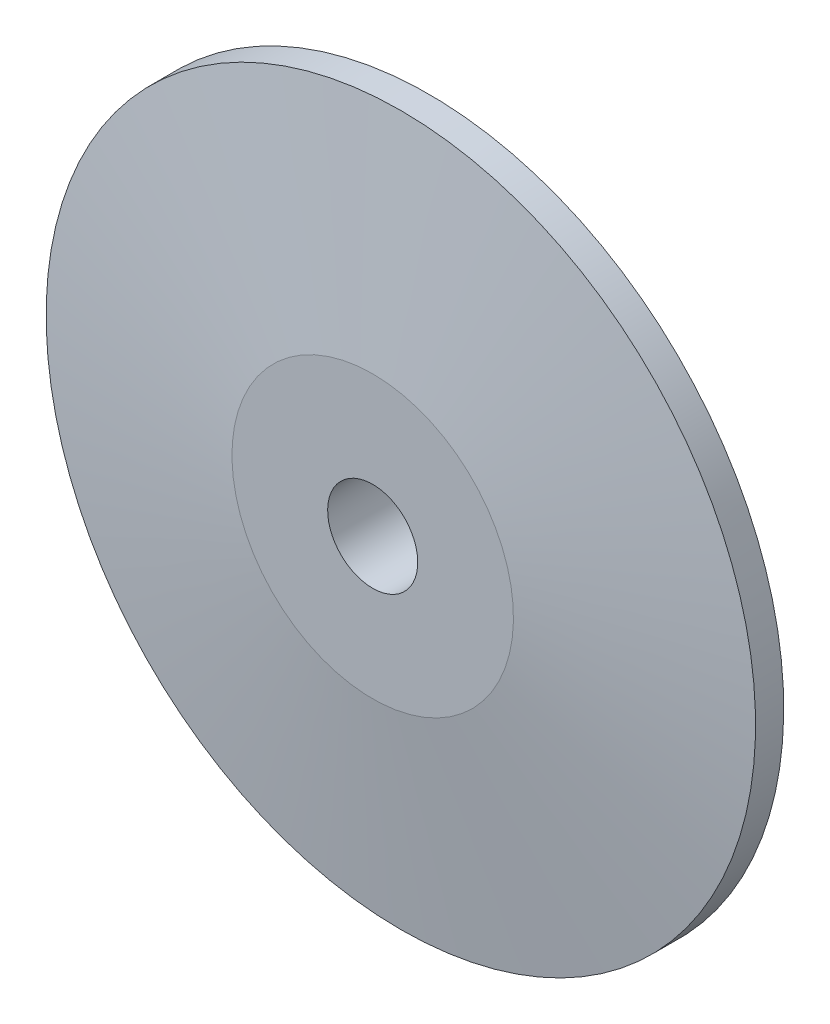
ISO-10303-21;
HEADER;
FILE_DESCRIPTION(('STEP AP214'),'2;1');
FILE_NAME('part.step','',(''),(''),'','','');
FILE_SCHEMA(('AUTOMOTIVE_DESIGN { 1 0 10303 214 1 1 1 1 }'));
ENDSEC;
DATA;
#1=APPLICATION_CONTEXT('core data for automotive mechanical design processes');
#2=APPLICATION_PROTOCOL_DEFINITION('international standard','automotive_design',2000,#1);
#3=PRODUCT_CONTEXT('',#1,'mechanical');
#4=PRODUCT('Part','Part','',(#3));
#5=PRODUCT_RELATED_PRODUCT_CATEGORY('part','',(#4));
#6=PRODUCT_DEFINITION_FORMATION('','',#4);
#7=PRODUCT_DEFINITION_CONTEXT('part definition',#1,'design');
#8=PRODUCT_DEFINITION('design','',#6,#7);
#9=PRODUCT_DEFINITION_SHAPE('','',#8);
#10=(LENGTH_UNIT() NAMED_UNIT(*) SI_UNIT(.MILLI.,.METRE.));
#11=(NAMED_UNIT(*) PLANE_ANGLE_UNIT() SI_UNIT($,.RADIAN.));
#12=(NAMED_UNIT(*) SI_UNIT($,.STERADIAN.) SOLID_ANGLE_UNIT());
#13=UNCERTAINTY_MEASURE_WITH_UNIT(LENGTH_MEASURE(1.E-05),#10,'distance_accuracy_value','');
#14=(GEOMETRIC_REPRESENTATION_CONTEXT(3) GLOBAL_UNCERTAINTY_ASSIGNED_CONTEXT((#13)) GLOBAL_UNIT_ASSIGNED_CONTEXT((#10,
#11,#12)) REPRESENTATION_CONTEXT('',''));
#15=CARTESIAN_POINT('',(0.,0.,0.));
#16=DIRECTION('',(0.,0.,1.));
#17=DIRECTION('',(1.,0.,0.));
#18=AXIS2_PLACEMENT_3D('',#15,#16,#17);
#19=CARTESIAN_POINT('',(0.,0.,0.));
#20=DIRECTION('',(0.,0.,1.));
#21=DIRECTION('',(0.,-1.,0.));
#22=AXIS2_PLACEMENT_3D('',#19,#20,#21);
#23=CYLINDRICAL_SURFACE('',#22,4.);
#24=CARTESIAN_POINT('',(0.,0.,0.));
#25=DIRECTION('',(0.,0.,-1.));
#26=DIRECTION('',(0.,1.,0.));
#27=AXIS2_PLACEMENT_3D('',#24,#25,#26);
#28=CIRCLE('',#27,4.);
#29=CARTESIAN_POINT('',(0.,4.,0.));
#30=VERTEX_POINT('',#29);
#31=EDGE_CURVE('E11',#30,#30,#28,.T.);
#32=ORIENTED_EDGE('',*,*,#31,.T.);
#33=EDGE_LOOP('',(#32));
#34=FACE_BOUND('',#33,.T.);
#35=CARTESIAN_POINT('',(0.,0.,20.));
#36=DIRECTION('',(0.,0.,-1.));
#37=DIRECTION('',(0.,1.,0.));
#38=AXIS2_PLACEMENT_3D('',#35,#36,#37);
#39=CIRCLE('',#38,4.);
#40=CARTESIAN_POINT('',(0.,-4.,20.));
#41=VERTEX_POINT('',#40);
#42=EDGE_CURVE('E99',#41,#41,#39,.T.);
#43=ORIENTED_EDGE('',*,*,#42,.F.);
#44=EDGE_LOOP('',(#43));
#45=FACE_BOUND('',#44,.T.);
#46=ADVANCED_FACE('F16',(#34,#45),#23,.F.);
#47=CARTESIAN_POINT('',(0.,0.,4.));
#48=DIRECTION('',(0.,0.,-1.));
#49=DIRECTION('',(0.,1.,0.));
#50=AXIS2_PLACEMENT_3D('',#47,#48,#49);
#51=CYLINDRICAL_SURFACE('',#50,7.5);
#52=CARTESIAN_POINT('',(0.,0.,4.));
#53=DIRECTION('',(0.,0.,-1.));
#54=DIRECTION('',(0.,1.,0.));
#55=AXIS2_PLACEMENT_3D('',#52,#53,#54);
#56=CIRCLE('',#55,7.5);
#57=CARTESIAN_POINT('',(0.,-7.5,4.));
#58=VERTEX_POINT('',#57);
#59=EDGE_CURVE('E26',#58,#58,#56,.T.);
#60=ORIENTED_EDGE('',*,*,#59,.T.);
#61=EDGE_LOOP('',(#60));
#62=FACE_BOUND('',#61,.T.);
#63=CARTESIAN_POINT('',(0.,0.,0.));
#64=DIRECTION('',(0.,0.,-1.));
#65=DIRECTION('',(0.,1.,0.));
#66=AXIS2_PLACEMENT_3D('',#63,#64,#65);
#67=CIRCLE('',#66,7.5);
#68=CARTESIAN_POINT('',(0.,7.5,0.));
#69=VERTEX_POINT('',#68);
#70=EDGE_CURVE('E103',#69,#69,#67,.T.);
#71=ORIENTED_EDGE('',*,*,#70,.F.);
#72=EDGE_LOOP('',(#71));
#73=FACE_BOUND('',#72,.T.);
#74=ADVANCED_FACE('F125',(#62,#73),#51,.T.);
#75=CARTESIAN_POINT('',(0.,0.,15.0213642611436));
#76=DIRECTION('',(0.,0.,-1.));
#77=DIRECTION('',(0.,1.,0.));
#78=AXIS2_PLACEMENT_3D('',#75,#76,#77);
#79=CONICAL_SURFACE('',#78,31.1738637185715,1.43996893072084);
#80=CARTESIAN_POINT('',(0.,0.,17.5));
#81=DIRECTION('',(0.,0.,1.));
#82=DIRECTION('',(0.,1.,0.));
#83=AXIS2_PLACEMENT_3D('',#80,#81,#82);
#84=CIRCLE('',#83,12.3362321032632);
#85=CARTESIAN_POINT('',(0.,-12.3362321032632,17.5));
#86=VERTEX_POINT('',#85);
#87=EDGE_CURVE('E108',#86,#86,#84,.T.);
#88=ORIENTED_EDGE('',*,*,#87,.T.);
#89=EDGE_LOOP('',(#88));
#90=FACE_BOUND('',#89,.T.);
#91=CARTESIAN_POINT('',(0.,0.,15.3073989609557));
#92=DIRECTION('',(0.,0.,1.));
#93=DIRECTION('',(0.,1.,0.));
#94=AXIS2_PLACEMENT_3D('',#91,#92,#93);
#95=CIRCLE('',#94,29.);
#96=CARTESIAN_POINT('',(0.,29.,15.3073989609557));
#97=VERTEX_POINT('',#96);
#98=EDGE_CURVE('E116',#97,#97,#95,.T.);
#99=ORIENTED_EDGE('',*,*,#98,.F.);
#100=EDGE_LOOP('',(#99));
#101=FACE_BOUND('',#100,.T.);
#102=ADVANCED_FACE('F143',(#90,#101),#79,.F.);
#103=CARTESIAN_POINT('',(0.,0.,15.));
#104=DIRECTION('',(0.,0.,1.));
#105=DIRECTION('',(0.,-1.,0.));
#106=AXIS2_PLACEMENT_3D('',#103,#104,#105);
#107=CYLINDRICAL_SURFACE('',#106,29.);
#108=CARTESIAN_POINT('',(0.,0.,15.));
#109=DIRECTION('',(0.,0.,-1.));
#110=DIRECTION('',(0.,1.,0.));
#111=AXIS2_PLACEMENT_3D('',#108,#109,#110);
#112=CIRCLE('',#111,29.);
#113=CARTESIAN_POINT('',(0.,29.,15.));
#114=VERTEX_POINT('',#113);
#115=EDGE_CURVE('E112',#114,#114,#112,.T.);
#116=ORIENTED_EDGE('',*,*,#115,.T.);
#117=EDGE_LOOP('',(#116));
#118=FACE_BOUND('',#117,.T.);
#119=ORIENTED_EDGE('',*,*,#98,.T.);
#120=EDGE_LOOP('',(#119));
#121=FACE_BOUND('',#120,.T.);
#122=ADVANCED_FACE('F169',(#118,#121),#107,.F.);
#123=CARTESIAN_POINT('',(0.,0.,17.5));
#124=DIRECTION('',(0.,0.,-1.));
#125=DIRECTION('',(0.,1.,0.));
#126=AXIS2_PLACEMENT_3D('',#123,#124,#125);
#127=CONICAL_SURFACE('',#126,31.5,1.43996893072084);
#128=CARTESIAN_POINT('',(0.,0.,20.));
#129=DIRECTION('',(0.,0.,1.));
#130=DIRECTION('',(0.,-1.,0.));
#131=AXIS2_PLACEMENT_3D('',#128,#129,#130);
#132=CIRCLE('',#131,12.5);
#133=CARTESIAN_POINT('',(0.,12.5,20.));
#134=VERTEX_POINT('',#133);
#135=EDGE_CURVE('E90',#134,#134,#132,.T.);
#136=ORIENTED_EDGE('',*,*,#135,.F.);
#137=EDGE_LOOP('',(#136));
#138=FACE_BOUND('',#137,.T.);
#139=CARTESIAN_POINT('',(0.,0.,17.5));
#140=DIRECTION('',(0.,0.,1.));
#141=DIRECTION('',(0.,-1.,0.));
#142=AXIS2_PLACEMENT_3D('',#139,#140,#141);
#143=CIRCLE('',#142,31.5);
#144=CARTESIAN_POINT('',(0.,31.5,17.5));
#145=VERTEX_POINT('',#144);
#146=EDGE_CURVE('E96',#145,#145,#143,.T.);
#147=ORIENTED_EDGE('',*,*,#146,.T.);
#148=EDGE_LOOP('',(#147));
#149=FACE_BOUND('',#148,.T.);
#150=ADVANCED_FACE('F163',(#138,#149),#127,.T.);
#151=CARTESIAN_POINT('',(0.,0.,15.));
#152=DIRECTION('',(0.,0.,1.));
#153=DIRECTION('',(0.,-1.,0.));
#154=AXIS2_PLACEMENT_3D('',#151,#152,#153);
#155=CYLINDRICAL_SURFACE('',#154,31.5);
#156=CARTESIAN_POINT('',(0.,0.,15.));
#157=DIRECTION('',(0.,0.,-1.));
#158=DIRECTION('',(0.,1.,0.));
#159=AXIS2_PLACEMENT_3D('',#156,#157,#158);
#160=CIRCLE('',#159,31.5);
#161=CARTESIAN_POINT('',(0.,-31.5,15.));
#162=VERTEX_POINT('',#161);
#163=EDGE_CURVE('E107',#162,#162,#160,.T.);
#164=ORIENTED_EDGE('',*,*,#163,.F.);
#165=EDGE_LOOP('',(#164));
#166=FACE_BOUND('',#165,.T.);
#167=ORIENTED_EDGE('',*,*,#146,.F.);
#168=EDGE_LOOP('',(#167));
#169=FACE_BOUND('',#168,.T.);
#170=ADVANCED_FACE('F159',(#166,#169),#155,.T.);
#171=CARTESIAN_POINT('',(0.,0.,42.6730014102411));
#172=DIRECTION('',(0.,0.,-1.));
#173=DIRECTION('',(0.,1.,0.));
#174=AXIS2_PLACEMENT_3D('',#171,#172,#173);
#175=CYLINDRICAL_SURFACE('',#174,8.9);
#176=CARTESIAN_POINT('',(0.,0.,17.5));
#177=DIRECTION('',(0.,0.,-1.));
#178=DIRECTION('',(0.,1.,0.));
#179=AXIS2_PLACEMENT_3D('',#176,#177,#178);
#180=CIRCLE('',#179,8.9);
#181=CARTESIAN_POINT('',(0.,-8.9,17.5));
#182=VERTEX_POINT('',#181);
#183=EDGE_CURVE('E19',#182,#182,#180,.T.);
#184=ORIENTED_EDGE('',*,*,#183,.T.);
#185=EDGE_LOOP('',(#184));
#186=FACE_BOUND('',#185,.T.);
#187=CARTESIAN_POINT('',(0.,0.,4.));
#188=DIRECTION('',(0.,0.,1.));
#189=DIRECTION('',(0.,1.,0.));
#190=AXIS2_PLACEMENT_3D('',#187,#188,#189);
#191=CIRCLE('',#190,8.9);
#192=CARTESIAN_POINT('',(0.,8.9,4.));
#193=VERTEX_POINT('',#192);
#194=EDGE_CURVE('E85',#193,#193,#191,.T.);
#195=ORIENTED_EDGE('',*,*,#194,.T.);
#196=EDGE_LOOP('',(#195));
#197=FACE_BOUND('',#196,.T.);
#198=ADVANCED_FACE('F150',(#186,#197),#175,.T.);
#199=CARTESIAN_POINT('',(0.,0.,20.));
#200=DIRECTION('',(0.,0.,-1.));
#201=DIRECTION('',(1.,0.,0.));
#202=AXIS2_PLACEMENT_3D('',#199,#200,#201);
#203=PLANE('',#202);
#204=ORIENTED_EDGE('',*,*,#135,.T.);
#205=EDGE_LOOP('',(#204));
#206=FACE_BOUND('',#205,.T.);
#207=ORIENTED_EDGE('',*,*,#42,.T.);
#208=EDGE_LOOP('',(#207));
#209=FACE_BOUND('',#208,.T.);
#210=ADVANCED_FACE('F147',(#206,#209),#203,.F.);
#211=CARTESIAN_POINT('',(0.,0.,0.));
#212=DIRECTION('',(0.,0.,-1.));
#213=DIRECTION('',(1.,0.,0.));
#214=AXIS2_PLACEMENT_3D('',#211,#212,#213);
#215=PLANE('',#214);
#216=ORIENTED_EDGE('',*,*,#70,.T.);
#217=EDGE_LOOP('',(#216));
#218=FACE_BOUND('',#217,.T.);
#219=ORIENTED_EDGE('',*,*,#31,.F.);
#220=EDGE_LOOP('',(#219));
#221=FACE_BOUND('',#220,.T.);
#222=ADVANCED_FACE('F149',(#218,#221),#215,.T.);
#223=CARTESIAN_POINT('',(0.,0.,15.));
#224=DIRECTION('',(0.,0.,-1.));
#225=DIRECTION('',(1.,0.,0.));
#226=AXIS2_PLACEMENT_3D('',#223,#224,#225);
#227=PLANE('',#226);
#228=ORIENTED_EDGE('',*,*,#163,.T.);
#229=EDGE_LOOP('',(#228));
#230=FACE_BOUND('',#229,.T.);
#231=ORIENTED_EDGE('',*,*,#115,.F.);
#232=EDGE_LOOP('',(#231));
#233=FACE_BOUND('',#232,.T.);
#234=ADVANCED_FACE('F134',(#230,#233),#227,.T.);
#235=CARTESIAN_POINT('',(0.,0.,17.5));
#236=DIRECTION('',(0.,0.,-1.));
#237=DIRECTION('',(1.,0.,0.));
#238=AXIS2_PLACEMENT_3D('',#235,#236,#237);
#239=PLANE('',#238);
#240=ORIENTED_EDGE('',*,*,#87,.F.);
#241=EDGE_LOOP('',(#240));
#242=FACE_BOUND('',#241,.T.);
#243=ORIENTED_EDGE('',*,*,#183,.F.);
#244=EDGE_LOOP('',(#243));
#245=FACE_BOUND('',#244,.T.);
#246=ADVANCED_FACE('F128',(#242,#245),#239,.T.);
#247=CARTESIAN_POINT('',(0.,0.,4.));
#248=DIRECTION('',(0.,0.,-1.));
#249=DIRECTION('',(1.,0.,0.));
#250=AXIS2_PLACEMENT_3D('',#247,#248,#249);
#251=PLANE('',#250);
#252=ORIENTED_EDGE('',*,*,#194,.F.);
#253=EDGE_LOOP('',(#252));
#254=FACE_BOUND('',#253,.T.);
#255=ORIENTED_EDGE('',*,*,#59,.F.);
#256=EDGE_LOOP('',(#255));
#257=FACE_BOUND('',#256,.T.);
#258=ADVANCED_FACE('F86',(#254,#257),#251,.T.);
#259=CLOSED_SHELL('',(#46,#74,#102,#122,#150,#170,#198,#210,#222,#234,#246,#258));
#260=MANIFOLD_SOLID_BREP('B1',#259);
#261=ADVANCED_BREP_SHAPE_REPRESENTATION('',(#18,#260),#14);
#262=SHAPE_DEFINITION_REPRESENTATION(#9,#261);
ENDSEC;
END-ISO-10303-21;
